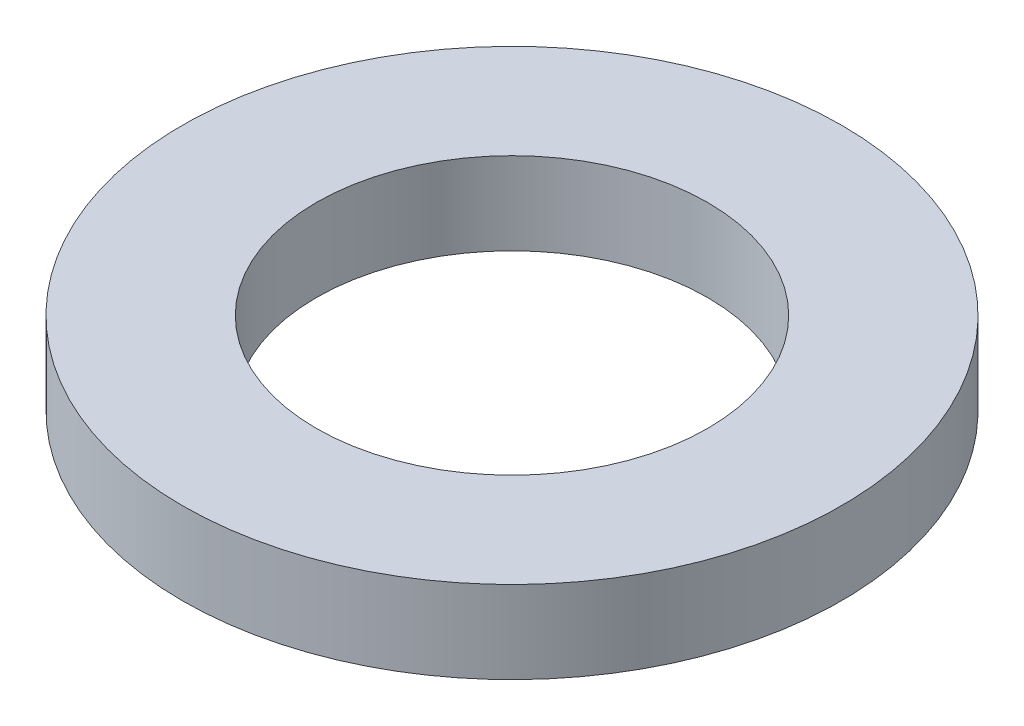
ISO-10303-21;
HEADER;
FILE_DESCRIPTION(('STEP AP214'),'2;1');
FILE_NAME('part.step','',(''),(''),'','','');
FILE_SCHEMA(('AUTOMOTIVE_DESIGN { 1 0 10303 214 1 1 1 1 }'));
ENDSEC;
DATA;
#1=APPLICATION_CONTEXT('core data for automotive mechanical design processes');
#2=APPLICATION_PROTOCOL_DEFINITION('international standard','automotive_design',2000,#1);
#3=PRODUCT_CONTEXT('',#1,'mechanical');
#4=PRODUCT('Part','Part','',(#3));
#5=PRODUCT_RELATED_PRODUCT_CATEGORY('part','',(#4));
#6=PRODUCT_DEFINITION_FORMATION('','',#4);
#7=PRODUCT_DEFINITION_CONTEXT('part definition',#1,'design');
#8=PRODUCT_DEFINITION('design','',#6,#7);
#9=PRODUCT_DEFINITION_SHAPE('','',#8);
#10=(LENGTH_UNIT() NAMED_UNIT(*) SI_UNIT(.MILLI.,.METRE.));
#11=(NAMED_UNIT(*) PLANE_ANGLE_UNIT() SI_UNIT($,.RADIAN.));
#12=(NAMED_UNIT(*) SI_UNIT($,.STERADIAN.) SOLID_ANGLE_UNIT());
#13=UNCERTAINTY_MEASURE_WITH_UNIT(LENGTH_MEASURE(1.E-05),#10,'distance_accuracy_value','');
#14=(GEOMETRIC_REPRESENTATION_CONTEXT(3) GLOBAL_UNCERTAINTY_ASSIGNED_CONTEXT((#13)) GLOBAL_UNIT_ASSIGNED_CONTEXT((#10,
#11,#12)) REPRESENTATION_CONTEXT('',''));
#15=CARTESIAN_POINT('',(0.,0.,0.));
#16=DIRECTION('',(0.,0.,1.));
#17=DIRECTION('',(1.,0.,0.));
#18=AXIS2_PLACEMENT_3D('',#15,#16,#17);
#19=CARTESIAN_POINT('',(0.,20.,0.));
#20=DIRECTION('',(0.,-1.,0.));
#21=DIRECTION('',(0.,0.,-1.));
#22=AXIS2_PLACEMENT_3D('',#19,#20,#21);
#23=CYLINDRICAL_SURFACE('',#22,80.);
#24=CARTESIAN_POINT('',(0.,20.,0.));
#25=DIRECTION('',(0.,1.,0.));
#26=DIRECTION('',(0.,0.,1.));
#27=AXIS2_PLACEMENT_3D('',#24,#25,#26);
#28=CIRCLE('',#27,80.);
#29=CARTESIAN_POINT('',(0.,20.,80.));
#30=VERTEX_POINT('',#29);
#31=EDGE_CURVE('E10',#30,#30,#28,.T.);
#32=ORIENTED_EDGE('',*,*,#31,.F.);
#33=EDGE_LOOP('',(#32));
#34=FACE_BOUND('',#33,.T.);
#35=CARTESIAN_POINT('',(0.,0.,0.));
#36=DIRECTION('',(0.,1.,0.));
#37=DIRECTION('',(0.,0.,1.));
#38=AXIS2_PLACEMENT_3D('',#35,#36,#37);
#39=CIRCLE('',#38,80.);
#40=CARTESIAN_POINT('',(0.,0.,80.));
#41=VERTEX_POINT('',#40);
#42=EDGE_CURVE('E37',#41,#41,#39,.T.);
#43=ORIENTED_EDGE('',*,*,#42,.T.);
#44=EDGE_LOOP('',(#43));
#45=FACE_BOUND('',#44,.T.);
#46=ADVANCED_FACE('F40',(#34,#45),#23,.T.);
#47=CARTESIAN_POINT('',(0.,20.,0.));
#48=DIRECTION('',(0.,1.,0.));
#49=DIRECTION('',(0.,0.,1.));
#50=AXIS2_PLACEMENT_3D('',#47,#48,#49);
#51=PLANE('',#50);
#52=CARTESIAN_POINT('',(0.,20.,0.));
#53=DIRECTION('',(0.,1.,0.));
#54=DIRECTION('',(0.,0.,1.));
#55=AXIS2_PLACEMENT_3D('',#52,#53,#54);
#56=CIRCLE('',#55,47.5);
#57=CARTESIAN_POINT('',(0.,20.,47.5));
#58=VERTEX_POINT('',#57);
#59=EDGE_CURVE('E50',#58,#58,#56,.T.);
#60=ORIENTED_EDGE('',*,*,#59,.F.);
#61=EDGE_LOOP('',(#60));
#62=FACE_BOUND('',#61,.T.);
#63=ORIENTED_EDGE('',*,*,#31,.T.);
#64=EDGE_LOOP('',(#63));
#65=FACE_BOUND('',#64,.T.);
#66=ADVANCED_FACE('F59',(#62,#65),#51,.T.);
#67=CARTESIAN_POINT('',(0.,0.,0.));
#68=DIRECTION('',(0.,1.,0.));
#69=DIRECTION('',(0.,0.,1.));
#70=AXIS2_PLACEMENT_3D('',#67,#68,#69);
#71=PLANE('',#70);
#72=CARTESIAN_POINT('',(0.,0.,0.));
#73=DIRECTION('',(0.,1.,0.));
#74=DIRECTION('',(0.,0.,1.));
#75=AXIS2_PLACEMENT_3D('',#72,#73,#74);
#76=CIRCLE('',#75,47.5);
#77=CARTESIAN_POINT('',(0.,0.,47.5));
#78=VERTEX_POINT('',#77);
#79=EDGE_CURVE('E47',#78,#78,#76,.T.);
#80=ORIENTED_EDGE('',*,*,#79,.T.);
#81=EDGE_LOOP('',(#80));
#82=FACE_BOUND('',#81,.T.);
#83=ORIENTED_EDGE('',*,*,#42,.F.);
#84=EDGE_LOOP('',(#83));
#85=FACE_BOUND('',#84,.T.);
#86=ADVANCED_FACE('F58',(#82,#85),#71,.F.);
#87=CARTESIAN_POINT('',(0.,20.,0.));
#88=DIRECTION('',(0.,-1.,0.));
#89=DIRECTION('',(0.,0.,-1.));
#90=AXIS2_PLACEMENT_3D('',#87,#88,#89);
#91=CYLINDRICAL_SURFACE('',#90,47.5);
#92=ORIENTED_EDGE('',*,*,#59,.T.);
#93=EDGE_LOOP('',(#92));
#94=FACE_BOUND('',#93,.T.);
#95=ORIENTED_EDGE('',*,*,#79,.F.);
#96=EDGE_LOOP('',(#95));
#97=FACE_BOUND('',#96,.T.);
#98=ADVANCED_FACE('F54',(#94,#97),#91,.F.);
#99=CLOSED_SHELL('',(#46,#66,#86,#98));
#100=MANIFOLD_SOLID_BREP('B2',#99);
#101=ADVANCED_BREP_SHAPE_REPRESENTATION('',(#18,#100),#14);
#102=SHAPE_DEFINITION_REPRESENTATION(#9,#101);
ENDSEC;
END-ISO-10303-21;
